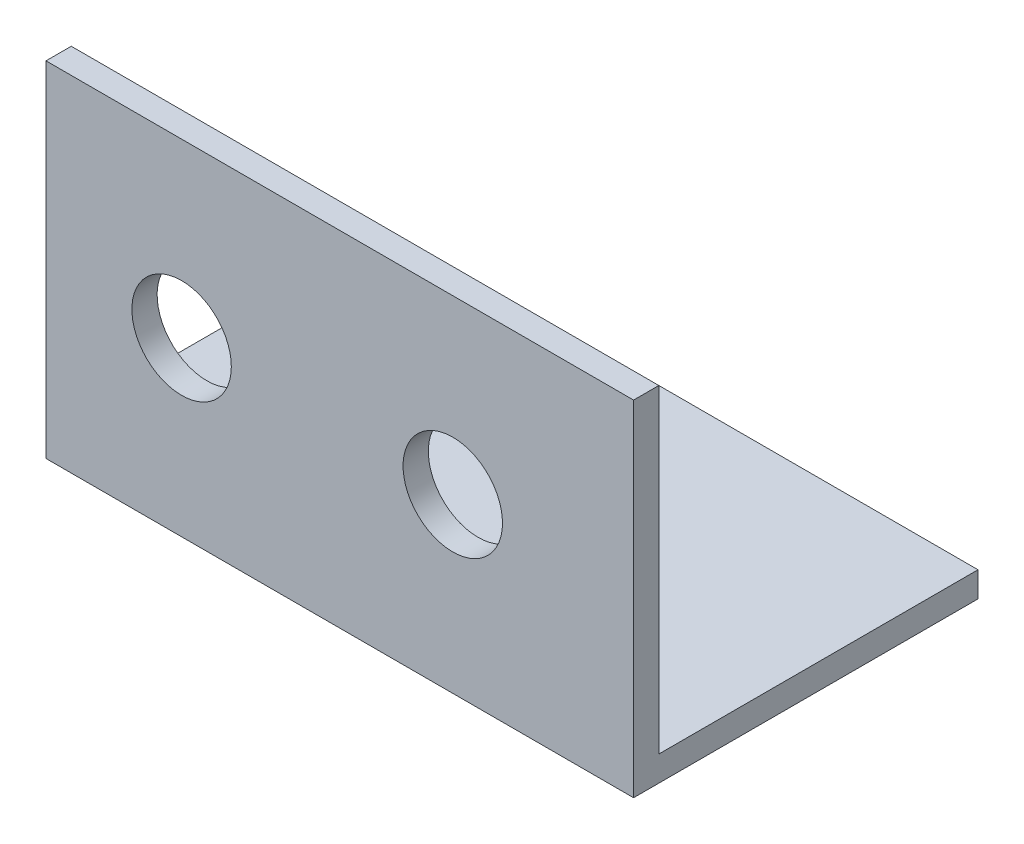
ISO-10303-21;
HEADER;
FILE_DESCRIPTION(('STEP AP214'),'2;1');
FILE_NAME('part.step','',(''),(''),'','','');
FILE_SCHEMA(('AUTOMOTIVE_DESIGN { 1 0 10303 214 1 1 1 1 }'));
ENDSEC;
DATA;
#1=APPLICATION_CONTEXT('core data for automotive mechanical design processes');
#2=APPLICATION_PROTOCOL_DEFINITION('international standard','automotive_design',2000,#1);
#3=PRODUCT_CONTEXT('',#1,'mechanical');
#4=PRODUCT('Part','Part','',(#3));
#5=PRODUCT_RELATED_PRODUCT_CATEGORY('part','',(#4));
#6=PRODUCT_DEFINITION_FORMATION('','',#4);
#7=PRODUCT_DEFINITION_CONTEXT('part definition',#1,'design');
#8=PRODUCT_DEFINITION('design','',#6,#7);
#9=PRODUCT_DEFINITION_SHAPE('','',#8);
#10=(LENGTH_UNIT() NAMED_UNIT(*) SI_UNIT(.MILLI.,.METRE.));
#11=(NAMED_UNIT(*) PLANE_ANGLE_UNIT() SI_UNIT($,.RADIAN.));
#12=(NAMED_UNIT(*) SI_UNIT($,.STERADIAN.) SOLID_ANGLE_UNIT());
#13=UNCERTAINTY_MEASURE_WITH_UNIT(LENGTH_MEASURE(1.E-05),#10,'distance_accuracy_value','');
#14=(GEOMETRIC_REPRESENTATION_CONTEXT(3) GLOBAL_UNCERTAINTY_ASSIGNED_CONTEXT((#13)) GLOBAL_UNIT_ASSIGNED_CONTEXT((#10,
#11,#12)) REPRESENTATION_CONTEXT('',''));
#15=CARTESIAN_POINT('',(0.,0.,0.));
#16=DIRECTION('',(0.,0.,1.));
#17=DIRECTION('',(1.,0.,0.));
#18=AXIS2_PLACEMENT_3D('',#15,#16,#17);
#19=CARTESIAN_POINT('',(65.,35.306,0.));
#20=DIRECTION('',(0.,-1.,0.));
#21=DIRECTION('',(0.,0.,-1.));
#22=AXIS2_PLACEMENT_3D('',#19,#20,#21);
#23=PLANE('',#22);
#24=DIRECTION('',(0.,0.,1.));
#25=VECTOR('',#24,1.);
#26=CARTESIAN_POINT('',(0.,35.306,0.));
#27=LINE('',#26,#25);
#28=CARTESIAN_POINT('',(0.,35.306,0.));
#29=VERTEX_POINT('',#28);
#30=CARTESIAN_POINT('',(0.,35.306,2.794));
#31=VERTEX_POINT('',#30);
#32=EDGE_CURVE('E118',#29,#31,#27,.T.);
#33=ORIENTED_EDGE('',*,*,#32,.T.);
#34=DIRECTION('',(-1.,0.,0.));
#35=VECTOR('',#34,1.);
#36=CARTESIAN_POINT('',(65.,35.306,2.794));
#37=LINE('',#36,#35);
#38=CARTESIAN_POINT('',(65.,35.306,2.794));
#39=VERTEX_POINT('',#38);
#40=EDGE_CURVE('E11',#39,#31,#37,.T.);
#41=ORIENTED_EDGE('',*,*,#40,.F.);
#42=DIRECTION('',(0.,0.,1.));
#43=VECTOR('',#42,1.);
#44=CARTESIAN_POINT('',(65.,35.306,0.));
#45=LINE('',#44,#43);
#46=CARTESIAN_POINT('',(65.,35.306,0.));
#47=VERTEX_POINT('',#46);
#48=EDGE_CURVE('E128',#47,#39,#45,.T.);
#49=ORIENTED_EDGE('',*,*,#48,.F.);
#50=DIRECTION('',(-1.,0.,0.));
#51=VECTOR('',#50,1.);
#52=CARTESIAN_POINT('',(65.,35.306,0.));
#53=LINE('',#52,#51);
#54=EDGE_CURVE('E114',#47,#29,#53,.T.);
#55=ORIENTED_EDGE('',*,*,#54,.T.);
#56=EDGE_LOOP('',(#33,#41,#49,#55));
#57=FACE_BOUND('',#56,.T.);
#58=ADVANCED_FACE('F32',(#57),#23,.F.);
#59=CARTESIAN_POINT('',(65.,-2.794,2.794));
#60=DIRECTION('',(0.,0.,-1.));
#61=DIRECTION('',(-1.,0.,0.));
#62=AXIS2_PLACEMENT_3D('',#59,#60,#61);
#63=PLANE('',#62);
#64=CARTESIAN_POINT('',(15.,16.256,2.794));
#65=DIRECTION('',(0.,0.,1.));
#66=DIRECTION('',(1.,0.,0.));
#67=AXIS2_PLACEMENT_3D('',#64,#65,#66);
#68=CIRCLE('',#67,5.5);
#69=CARTESIAN_POINT('',(20.5,16.256,2.794));
#70=VERTEX_POINT('',#69);
#71=EDGE_CURVE('E135',#70,#70,#68,.T.);
#72=ORIENTED_EDGE('',*,*,#71,.F.);
#73=EDGE_LOOP('',(#72));
#74=FACE_BOUND('',#73,.T.);
#75=CARTESIAN_POINT('',(45.,16.256,2.794));
#76=DIRECTION('',(0.,0.,1.));
#77=DIRECTION('',(1.,0.,0.));
#78=AXIS2_PLACEMENT_3D('',#75,#76,#77);
#79=CIRCLE('',#78,5.50000000000002);
#80=CARTESIAN_POINT('',(50.5,16.256,2.794));
#81=VERTEX_POINT('',#80);
#82=EDGE_CURVE('E140',#81,#81,#79,.T.);
#83=ORIENTED_EDGE('',*,*,#82,.F.);
#84=EDGE_LOOP('',(#83));
#85=FACE_BOUND('',#84,.T.);
#86=DIRECTION('',(0.,-1.,0.));
#87=VECTOR('',#86,1.);
#88=CARTESIAN_POINT('',(0.,-2.794,2.794));
#89=LINE('',#88,#87);
#90=CARTESIAN_POINT('',(0.,-2.794,2.794));
#91=VERTEX_POINT('',#90);
#92=EDGE_CURVE('E121',#31,#91,#89,.T.);
#93=ORIENTED_EDGE('',*,*,#92,.T.);
#94=DIRECTION('',(-1.,0.,0.));
#95=VECTOR('',#94,1.);
#96=CARTESIAN_POINT('',(65.,-2.794,2.794));
#97=LINE('',#96,#95);
#98=CARTESIAN_POINT('',(65.,-2.794,2.794));
#99=VERTEX_POINT('',#98);
#100=EDGE_CURVE('E41',#99,#91,#97,.T.);
#101=ORIENTED_EDGE('',*,*,#100,.F.);
#102=DIRECTION('',(0.,-1.,0.));
#103=VECTOR('',#102,1.);
#104=CARTESIAN_POINT('',(65.,-2.794,2.794));
#105=LINE('',#104,#103);
#106=EDGE_CURVE('E87',#39,#99,#105,.T.);
#107=ORIENTED_EDGE('',*,*,#106,.F.);
#108=ORIENTED_EDGE('',*,*,#40,.T.);
#109=EDGE_LOOP('',(#93,#101,#107,#108));
#110=FACE_BOUND('',#109,.T.);
#111=ADVANCED_FACE('F150',(#74,#85,#110),#63,.F.);
#112=CARTESIAN_POINT('',(65.,-2.794,-35.306));
#113=DIRECTION('',(0.,1.,0.));
#114=DIRECTION('',(0.,0.,1.));
#115=AXIS2_PLACEMENT_3D('',#112,#113,#114);
#116=PLANE('',#115);
#117=DIRECTION('',(0.,0.,-1.));
#118=VECTOR('',#117,1.);
#119=CARTESIAN_POINT('',(0.,-2.794,-35.306));
#120=LINE('',#119,#118);
#121=CARTESIAN_POINT('',(0.,-2.794,-35.306));
#122=VERTEX_POINT('',#121);
#123=EDGE_CURVE('E123',#91,#122,#120,.T.);
#124=ORIENTED_EDGE('',*,*,#123,.T.);
#125=DIRECTION('',(-1.,0.,0.));
#126=VECTOR('',#125,1.);
#127=CARTESIAN_POINT('',(65.,-2.794,-35.306));
#128=LINE('',#127,#126);
#129=CARTESIAN_POINT('',(65.,-2.794,-35.306));
#130=VERTEX_POINT('',#129);
#131=EDGE_CURVE('E109',#130,#122,#128,.T.);
#132=ORIENTED_EDGE('',*,*,#131,.F.);
#133=DIRECTION('',(0.,0.,-1.));
#134=VECTOR('',#133,1.);
#135=CARTESIAN_POINT('',(65.,-2.794,-35.306));
#136=LINE('',#135,#134);
#137=EDGE_CURVE('E100',#99,#130,#136,.T.);
#138=ORIENTED_EDGE('',*,*,#137,.F.);
#139=ORIENTED_EDGE('',*,*,#100,.T.);
#140=EDGE_LOOP('',(#124,#132,#138,#139));
#141=FACE_BOUND('',#140,.T.);
#142=ADVANCED_FACE('F153',(#141),#116,.F.);
#143=CARTESIAN_POINT('',(65.,0.,-35.306));
#144=DIRECTION('',(0.,0.,1.));
#145=DIRECTION('',(1.,0.,0.));
#146=AXIS2_PLACEMENT_3D('',#143,#144,#145);
#147=PLANE('',#146);
#148=DIRECTION('',(0.,1.,0.));
#149=VECTOR('',#148,1.);
#150=CARTESIAN_POINT('',(0.,0.,-35.306));
#151=LINE('',#150,#149);
#152=CARTESIAN_POINT('',(0.,0.,-35.306));
#153=VERTEX_POINT('',#152);
#154=EDGE_CURVE('E108',#122,#153,#151,.T.);
#155=ORIENTED_EDGE('',*,*,#154,.T.);
#156=DIRECTION('',(-1.,0.,0.));
#157=VECTOR('',#156,1.);
#158=CARTESIAN_POINT('',(65.,0.,-35.306));
#159=LINE('',#158,#157);
#160=CARTESIAN_POINT('',(65.,0.,-35.306));
#161=VERTEX_POINT('',#160);
#162=EDGE_CURVE('E105',#161,#153,#159,.T.);
#163=ORIENTED_EDGE('',*,*,#162,.F.);
#164=DIRECTION('',(0.,1.,0.));
#165=VECTOR('',#164,1.);
#166=CARTESIAN_POINT('',(65.,0.,-35.306));
#167=LINE('',#166,#165);
#168=EDGE_CURVE('E94',#130,#161,#167,.T.);
#169=ORIENTED_EDGE('',*,*,#168,.F.);
#170=ORIENTED_EDGE('',*,*,#131,.T.);
#171=EDGE_LOOP('',(#155,#163,#169,#170));
#172=FACE_BOUND('',#171,.T.);
#173=ADVANCED_FACE('F106',(#172),#147,.F.);
#174=CARTESIAN_POINT('',(65.,0.,0.));
#175=DIRECTION('',(0.,-1.,0.));
#176=DIRECTION('',(0.,0.,-1.));
#177=AXIS2_PLACEMENT_3D('',#174,#175,#176);
#178=PLANE('',#177);
#179=DIRECTION('',(0.,0.,1.));
#180=VECTOR('',#179,1.);
#181=CARTESIAN_POINT('',(0.,0.,0.));
#182=LINE('',#181,#180);
#183=CARTESIAN_POINT('',(0.,0.,0.));
#184=VERTEX_POINT('',#183);
#185=EDGE_CURVE('E73',#153,#184,#182,.T.);
#186=ORIENTED_EDGE('',*,*,#185,.T.);
#187=DIRECTION('',(-1.,0.,0.));
#188=VECTOR('',#187,1.);
#189=CARTESIAN_POINT('',(65.,0.,0.));
#190=LINE('',#189,#188);
#191=CARTESIAN_POINT('',(65.,0.,0.));
#192=VERTEX_POINT('',#191);
#193=EDGE_CURVE('E110',#192,#184,#190,.T.);
#194=ORIENTED_EDGE('',*,*,#193,.F.);
#195=DIRECTION('',(0.,0.,1.));
#196=VECTOR('',#195,1.);
#197=CARTESIAN_POINT('',(65.,0.,0.));
#198=LINE('',#197,#196);
#199=EDGE_CURVE('E98',#161,#192,#198,.T.);
#200=ORIENTED_EDGE('',*,*,#199,.F.);
#201=ORIENTED_EDGE('',*,*,#162,.T.);
#202=EDGE_LOOP('',(#186,#194,#200,#201));
#203=FACE_BOUND('',#202,.T.);
#204=ADVANCED_FACE('F112',(#203),#178,.F.);
#205=CARTESIAN_POINT('',(65.,35.306,0.));
#206=DIRECTION('',(0.,0.,1.));
#207=DIRECTION('',(0.,-1.,0.));
#208=AXIS2_PLACEMENT_3D('',#205,#206,#207);
#209=PLANE('',#208);
#210=CARTESIAN_POINT('',(15.,16.256,0.));
#211=DIRECTION('',(0.,0.,1.));
#212=DIRECTION('',(0.,-1.,0.));
#213=AXIS2_PLACEMENT_3D('',#210,#211,#212);
#214=CIRCLE('',#213,5.5);
#215=CARTESIAN_POINT('',(15.,10.756,0.));
#216=VERTEX_POINT('',#215);
#217=EDGE_CURVE('E35',#216,#216,#214,.T.);
#218=ORIENTED_EDGE('',*,*,#217,.T.);
#219=EDGE_LOOP('',(#218));
#220=FACE_BOUND('',#219,.T.);
#221=CARTESIAN_POINT('',(45.,16.256,0.));
#222=DIRECTION('',(0.,0.,1.));
#223=DIRECTION('',(0.,-1.,0.));
#224=AXIS2_PLACEMENT_3D('',#221,#222,#223);
#225=CIRCLE('',#224,5.50000000000002);
#226=CARTESIAN_POINT('',(45.,10.756,0.));
#227=VERTEX_POINT('',#226);
#228=EDGE_CURVE('E133',#227,#227,#225,.T.);
#229=ORIENTED_EDGE('',*,*,#228,.T.);
#230=EDGE_LOOP('',(#229));
#231=FACE_BOUND('',#230,.T.);
#232=DIRECTION('',(0.,1.,0.));
#233=VECTOR('',#232,1.);
#234=CARTESIAN_POINT('',(0.,35.306,0.));
#235=LINE('',#234,#233);
#236=EDGE_CURVE('E79',#184,#29,#235,.T.);
#237=ORIENTED_EDGE('',*,*,#236,.T.);
#238=ORIENTED_EDGE('',*,*,#54,.F.);
#239=DIRECTION('',(0.,1.,0.));
#240=VECTOR('',#239,1.);
#241=CARTESIAN_POINT('',(65.,35.306,0.));
#242=LINE('',#241,#240);
#243=EDGE_CURVE('E50',#192,#47,#242,.T.);
#244=ORIENTED_EDGE('',*,*,#243,.F.);
#245=ORIENTED_EDGE('',*,*,#193,.T.);
#246=EDGE_LOOP('',(#237,#238,#244,#245));
#247=FACE_BOUND('',#246,.T.);
#248=ADVANCED_FACE('F158',(#220,#231,#247),#209,.F.);
#249=CARTESIAN_POINT('',(65.,0.,0.));
#250=DIRECTION('',(-1.,0.,0.));
#251=DIRECTION('',(0.,0.,1.));
#252=AXIS2_PLACEMENT_3D('',#249,#250,#251);
#253=PLANE('',#252);
#254=ORIENTED_EDGE('',*,*,#48,.T.);
#255=ORIENTED_EDGE('',*,*,#106,.T.);
#256=ORIENTED_EDGE('',*,*,#137,.T.);
#257=ORIENTED_EDGE('',*,*,#168,.T.);
#258=ORIENTED_EDGE('',*,*,#199,.T.);
#259=ORIENTED_EDGE('',*,*,#243,.T.);
#260=EDGE_LOOP('',(#254,#255,#256,#257,#258,#259));
#261=FACE_BOUND('',#260,.T.);
#262=ADVANCED_FACE('F96',(#261),#253,.F.);
#263=CARTESIAN_POINT('',(0.,0.,0.));
#264=DIRECTION('',(-1.,0.,0.));
#265=DIRECTION('',(0.,0.,1.));
#266=AXIS2_PLACEMENT_3D('',#263,#264,#265);
#267=PLANE('',#266);
#268=ORIENTED_EDGE('',*,*,#32,.F.);
#269=ORIENTED_EDGE('',*,*,#236,.F.);
#270=ORIENTED_EDGE('',*,*,#185,.F.);
#271=ORIENTED_EDGE('',*,*,#154,.F.);
#272=ORIENTED_EDGE('',*,*,#123,.F.);
#273=ORIENTED_EDGE('',*,*,#92,.F.);
#274=EDGE_LOOP('',(#268,#269,#270,#271,#272,#273));
#275=FACE_BOUND('',#274,.T.);
#276=ADVANCED_FACE('F156',(#275),#267,.T.);
#277=CARTESIAN_POINT('',(45.,16.256,-62.206));
#278=DIRECTION('',(0.,0.,1.));
#279=DIRECTION('',(1.,0.,0.));
#280=AXIS2_PLACEMENT_3D('',#277,#278,#279);
#281=CYLINDRICAL_SURFACE('',#280,5.50000000000002);
#282=ORIENTED_EDGE('',*,*,#82,.T.);
#283=EDGE_LOOP('',(#282));
#284=FACE_BOUND('',#283,.T.);
#285=ORIENTED_EDGE('',*,*,#228,.F.);
#286=EDGE_LOOP('',(#285));
#287=FACE_BOUND('',#286,.T.);
#288=ADVANCED_FACE('F204',(#284,#287),#281,.F.);
#289=CARTESIAN_POINT('',(15.,16.256,-62.206));
#290=DIRECTION('',(0.,0.,1.));
#291=DIRECTION('',(1.,0.,0.));
#292=AXIS2_PLACEMENT_3D('',#289,#290,#291);
#293=CYLINDRICAL_SURFACE('',#292,5.5);
#294=ORIENTED_EDGE('',*,*,#71,.T.);
#295=EDGE_LOOP('',(#294));
#296=FACE_BOUND('',#295,.T.);
#297=ORIENTED_EDGE('',*,*,#217,.F.);
#298=EDGE_LOOP('',(#297));
#299=FACE_BOUND('',#298,.T.);
#300=ADVANCED_FACE('F209',(#296,#299),#293,.F.);
#301=CLOSED_SHELL('',(#58,#111,#142,#173,#204,#248,#262,#276,#288,#300));
#302=MANIFOLD_SOLID_BREP('B2',#301);
#303=ADVANCED_BREP_SHAPE_REPRESENTATION('',(#18,#302),#14);
#304=SHAPE_DEFINITION_REPRESENTATION(#9,#303);
ENDSEC;
END-ISO-10303-21;
